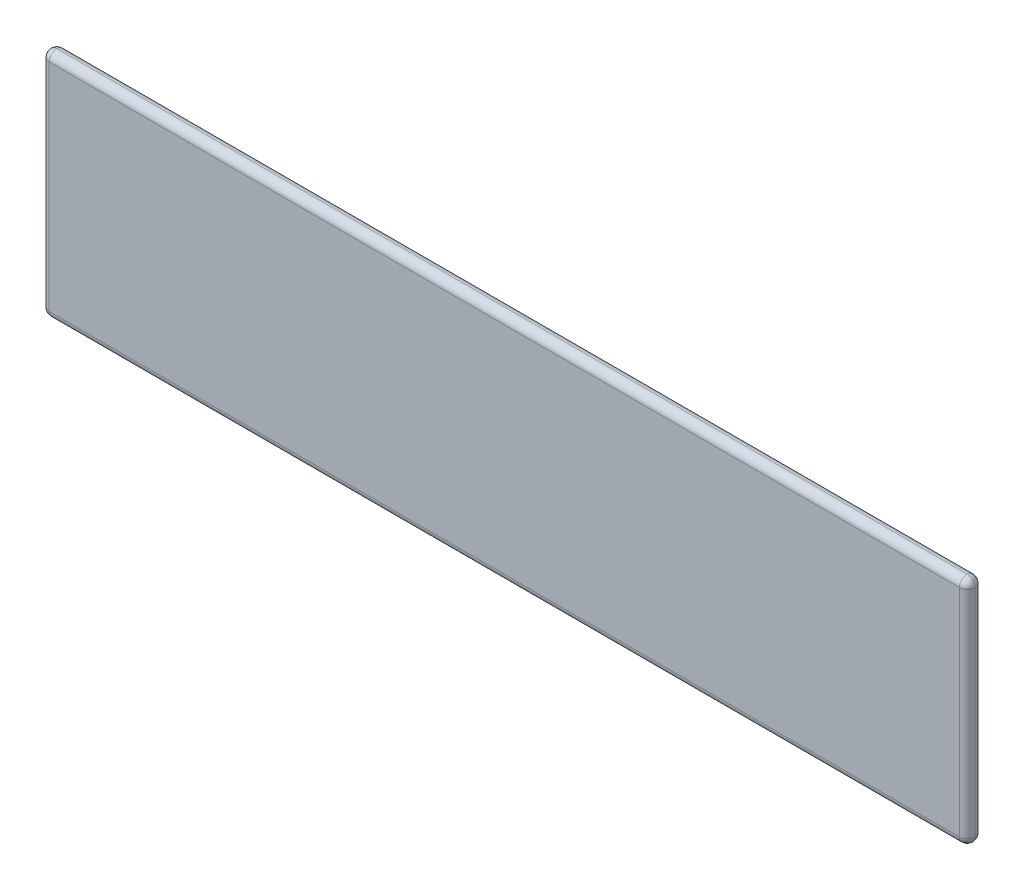
ISO-10303-21;
HEADER;
FILE_DESCRIPTION(('STEP AP214'),'2;1');
FILE_NAME('part.step','',(''),(''),'','','');
FILE_SCHEMA(('AUTOMOTIVE_DESIGN { 1 0 10303 214 1 1 1 1 }'));
ENDSEC;
DATA;
#1=APPLICATION_CONTEXT('core data for automotive mechanical design processes');
#2=APPLICATION_PROTOCOL_DEFINITION('international standard','automotive_design',2000,#1);
#3=PRODUCT_CONTEXT('',#1,'mechanical');
#4=PRODUCT('Part','Part','',(#3));
#5=PRODUCT_RELATED_PRODUCT_CATEGORY('part','',(#4));
#6=PRODUCT_DEFINITION_FORMATION('','',#4);
#7=PRODUCT_DEFINITION_CONTEXT('part definition',#1,'design');
#8=PRODUCT_DEFINITION('design','',#6,#7);
#9=PRODUCT_DEFINITION_SHAPE('','',#8);
#10=(LENGTH_UNIT() NAMED_UNIT(*) SI_UNIT(.MILLI.,.METRE.));
#11=(NAMED_UNIT(*) PLANE_ANGLE_UNIT() SI_UNIT($,.RADIAN.));
#12=(NAMED_UNIT(*) SI_UNIT($,.STERADIAN.) SOLID_ANGLE_UNIT());
#13=UNCERTAINTY_MEASURE_WITH_UNIT(LENGTH_MEASURE(1.E-05),#10,'distance_accuracy_value','');
#14=(GEOMETRIC_REPRESENTATION_CONTEXT(3) GLOBAL_UNCERTAINTY_ASSIGNED_CONTEXT((#13)) GLOBAL_UNIT_ASSIGNED_CONTEXT((#10,
#11,#12)) REPRESENTATION_CONTEXT('',''));
#15=CARTESIAN_POINT('',(0.,0.,0.));
#16=DIRECTION('',(0.,0.,1.));
#17=DIRECTION('',(1.,0.,0.));
#18=AXIS2_PLACEMENT_3D('',#15,#16,#17);
#19=CARTESIAN_POINT('',(0.,0.,10.));
#20=DIRECTION('',(0.,0.,1.));
#21=DIRECTION('',(1.,0.,0.));
#22=AXIS2_PLACEMENT_3D('',#19,#20,#21);
#23=PLANE('',#22);
#24=DIRECTION('',(-1.,0.,0.));
#25=VECTOR('',#24,1.);
#26=CARTESIAN_POINT('',(0.,-9.99999999999997,10.));
#27=LINE('',#26,#25);
#28=CARTESIAN_POINT('',(1190.,-9.99999999999997,10.));
#29=VERTEX_POINT('',#28);
#30=CARTESIAN_POINT('',(9.99999999999997,-9.99999999999997,10.));
#31=VERTEX_POINT('',#30);
#32=EDGE_CURVE('E120',#29,#31,#27,.T.);
#33=ORIENTED_EDGE('',*,*,#32,.T.);
#34=DIRECTION('',(0.,-1.,0.));
#35=VECTOR('',#34,1.);
#36=CARTESIAN_POINT('',(10.,-300.,10.));
#37=LINE('',#36,#35);
#38=CARTESIAN_POINT('',(10.,-290.,10.));
#39=VERTEX_POINT('',#38);
#40=EDGE_CURVE('E11',#31,#39,#37,.T.);
#41=ORIENTED_EDGE('',*,*,#40,.T.);
#42=DIRECTION('',(1.,0.,0.));
#43=VECTOR('',#42,1.);
#44=CARTESIAN_POINT('',(1200.,-290.,10.));
#45=LINE('',#44,#43);
#46=CARTESIAN_POINT('',(1190.,-290.,10.));
#47=VERTEX_POINT('',#46);
#48=EDGE_CURVE('E50',#39,#47,#45,.T.);
#49=ORIENTED_EDGE('',*,*,#48,.T.);
#50=DIRECTION('',(0.,1.,0.));
#51=VECTOR('',#50,1.);
#52=CARTESIAN_POINT('',(1190.,0.,10.));
#53=LINE('',#52,#51);
#54=EDGE_CURVE('E122',#47,#29,#53,.T.);
#55=ORIENTED_EDGE('',*,*,#54,.T.);
#56=EDGE_LOOP('',(#33,#41,#49,#55));
#57=FACE_BOUND('',#56,.T.);
#58=ADVANCED_FACE('F39',(#57),#23,.T.);
#59=CARTESIAN_POINT('',(0.,0.,-10.));
#60=DIRECTION('',(0.,0.,1.));
#61=DIRECTION('',(1.,0.,0.));
#62=AXIS2_PLACEMENT_3D('',#59,#60,#61);
#63=PLANE('',#62);
#64=DIRECTION('',(1.,0.,0.));
#65=VECTOR('',#64,1.);
#66=CARTESIAN_POINT('',(0.,-290.,-10.));
#67=LINE('',#66,#65);
#68=CARTESIAN_POINT('',(1190.,-290.,-10.));
#69=VERTEX_POINT('',#68);
#70=CARTESIAN_POINT('',(10.,-290.,-10.));
#71=VERTEX_POINT('',#70);
#72=EDGE_CURVE('E392',#69,#71,#67,.F.);
#73=ORIENTED_EDGE('',*,*,#72,.T.);
#74=DIRECTION('',(0.,-1.,0.));
#75=VECTOR('',#74,1.);
#76=CARTESIAN_POINT('',(9.99999999999997,0.,-10.));
#77=LINE('',#76,#75);
#78=CARTESIAN_POINT('',(9.99999999999997,-9.99999999999997,-10.));
#79=VERTEX_POINT('',#78);
#80=EDGE_CURVE('E127',#71,#79,#77,.F.);
#81=ORIENTED_EDGE('',*,*,#80,.T.);
#82=DIRECTION('',(-1.,0.,0.));
#83=VECTOR('',#82,1.);
#84=CARTESIAN_POINT('',(0.,-9.99999999999997,-10.));
#85=LINE('',#84,#83);
#86=CARTESIAN_POINT('',(1190.,-9.99999999999997,-10.));
#87=VERTEX_POINT('',#86);
#88=EDGE_CURVE('E323',#79,#87,#85,.F.);
#89=ORIENTED_EDGE('',*,*,#88,.T.);
#90=DIRECTION('',(0.,1.,0.));
#91=VECTOR('',#90,1.);
#92=CARTESIAN_POINT('',(1190.,0.,-10.));
#93=LINE('',#92,#91);
#94=EDGE_CURVE('E326',#87,#69,#93,.F.);
#95=ORIENTED_EDGE('',*,*,#94,.T.);
#96=EDGE_LOOP('',(#73,#81,#89,#95));
#97=FACE_BOUND('',#96,.T.);
#98=ADVANCED_FACE('F162',(#97),#63,.F.);
#99=CARTESIAN_POINT('',(1190.,0.,0.));
#100=DIRECTION('',(0.,-1.,0.));
#101=DIRECTION('',(0.,0.,-1.));
#102=AXIS2_PLACEMENT_3D('',#99,#100,#101);
#103=CYLINDRICAL_SURFACE('',#102,9.99999999999997);
#104=DIRECTION('',(0.,1.,0.));
#105=VECTOR('',#104,1.);
#106=CARTESIAN_POINT('',(1200.,-300.,0.));
#107=LINE('',#106,#105);
#108=CARTESIAN_POINT('',(1200.,-9.99999999999997,0.));
#109=VERTEX_POINT('',#108);
#110=CARTESIAN_POINT('',(1200.,-290.,0.));
#111=VERTEX_POINT('',#110);
#112=EDGE_CURVE('E312',#109,#111,#107,.F.);
#113=ORIENTED_EDGE('',*,*,#112,.F.);
#114=CARTESIAN_POINT('',(1190.,-9.99999999999997,0.));
#115=DIRECTION('',(0.,1.,0.));
#116=DIRECTION('',(0.,0.,1.));
#117=AXIS2_PLACEMENT_3D('',#114,#115,#116);
#118=CIRCLE('',#117,9.99999999999997);
#119=EDGE_CURVE('E43',#29,#109,#118,.T.);
#120=ORIENTED_EDGE('',*,*,#119,.F.);
#121=ORIENTED_EDGE('',*,*,#54,.F.);
#122=CARTESIAN_POINT('',(1190.,-290.,0.));
#123=DIRECTION('',(0.,-1.,0.));
#124=DIRECTION('',(0.,0.,-1.));
#125=AXIS2_PLACEMENT_3D('',#122,#123,#124);
#126=CIRCLE('',#125,9.99999999999997);
#127=EDGE_CURVE('E88',#111,#47,#126,.T.);
#128=ORIENTED_EDGE('',*,*,#127,.F.);
#129=EDGE_LOOP('',(#113,#120,#121,#128));
#130=FACE_BOUND('',#129,.T.);
#131=ADVANCED_FACE('F41',(#130),#103,.T.);
#132=CARTESIAN_POINT('',(1190.,-9.99999999999997,0.));
#133=DIRECTION('',(1.,0.,0.));
#134=DIRECTION('',(0.,0.,-1.));
#135=AXIS2_PLACEMENT_3D('',#132,#133,#134);
#136=SPHERICAL_SURFACE('',#135,9.99999999999997);
#137=ORIENTED_EDGE('',*,*,#119,.T.);
#138=CARTESIAN_POINT('',(1190.,-9.99999999999997,0.));
#139=DIRECTION('',(0.,0.,-1.));
#140=DIRECTION('',(-1.,0.,0.));
#141=AXIS2_PLACEMENT_3D('',#138,#139,#140);
#142=CIRCLE('',#141,9.99999999999997);
#143=CARTESIAN_POINT('',(1190.,0.,0.));
#144=VERTEX_POINT('',#143);
#145=EDGE_CURVE('E95',#144,#109,#142,.T.);
#146=ORIENTED_EDGE('',*,*,#145,.F.);
#147=CARTESIAN_POINT('',(1190.,-9.99999999999997,0.));
#148=DIRECTION('',(1.,0.,0.));
#149=DIRECTION('',(0.,0.,-1.));
#150=AXIS2_PLACEMENT_3D('',#147,#148,#149);
#151=CIRCLE('',#150,9.99999999999997);
#152=EDGE_CURVE('E321',#29,#144,#151,.F.);
#153=ORIENTED_EDGE('',*,*,#152,.F.);
#154=EDGE_LOOP('',(#137,#146,#153));
#155=FACE_BOUND('',#154,.T.);
#156=ADVANCED_FACE('F281',(#155),#136,.T.);
#157=CARTESIAN_POINT('',(1190.,-290.,0.));
#158=DIRECTION('',(1.,0.,0.));
#159=DIRECTION('',(0.,0.,-1.));
#160=AXIS2_PLACEMENT_3D('',#157,#158,#159);
#161=SPHERICAL_SURFACE('',#160,9.99999999999997);
#162=CARTESIAN_POINT('',(1190.,-290.,0.));
#163=DIRECTION('',(0.,0.,1.));
#164=DIRECTION('',(1.,0.,0.));
#165=AXIS2_PLACEMENT_3D('',#162,#163,#164);
#166=CIRCLE('',#165,9.99999999999997);
#167=CARTESIAN_POINT('',(1190.,-300.,0.));
#168=VERTEX_POINT('',#167);
#169=EDGE_CURVE('E318',#111,#168,#166,.F.);
#170=ORIENTED_EDGE('',*,*,#169,.F.);
#171=ORIENTED_EDGE('',*,*,#127,.T.);
#172=CARTESIAN_POINT('',(1190.,-290.,0.));
#173=DIRECTION('',(1.,0.,0.));
#174=DIRECTION('',(0.,0.,-1.));
#175=AXIS2_PLACEMENT_3D('',#172,#173,#174);
#176=CIRCLE('',#175,9.99999999999997);
#177=EDGE_CURVE('E339',#168,#47,#176,.F.);
#178=ORIENTED_EDGE('',*,*,#177,.F.);
#179=EDGE_LOOP('',(#170,#171,#178));
#180=FACE_BOUND('',#179,.T.);
#181=ADVANCED_FACE('F271',(#180),#161,.T.);
#182=CARTESIAN_POINT('',(1190.,0.,0.));
#183=DIRECTION('',(0.,1.,0.));
#184=DIRECTION('',(0.,0.,1.));
#185=AXIS2_PLACEMENT_3D('',#182,#183,#184);
#186=CYLINDRICAL_SURFACE('',#185,9.99999999999997);
#187=CARTESIAN_POINT('',(1190.,-9.99999999999997,0.));
#188=DIRECTION('',(0.,1.,0.));
#189=DIRECTION('',(0.,0.,1.));
#190=AXIS2_PLACEMENT_3D('',#187,#188,#189);
#191=CIRCLE('',#190,9.99999999999997);
#192=EDGE_CURVE('E319',#109,#87,#191,.T.);
#193=ORIENTED_EDGE('',*,*,#192,.F.);
#194=ORIENTED_EDGE('',*,*,#112,.T.);
#195=CARTESIAN_POINT('',(1190.,-290.,0.));
#196=DIRECTION('',(0.,-1.,0.));
#197=DIRECTION('',(0.,0.,-1.));
#198=AXIS2_PLACEMENT_3D('',#195,#196,#197);
#199=CIRCLE('',#198,9.99999999999997);
#200=EDGE_CURVE('E342',#69,#111,#199,.T.);
#201=ORIENTED_EDGE('',*,*,#200,.F.);
#202=ORIENTED_EDGE('',*,*,#94,.F.);
#203=EDGE_LOOP('',(#193,#194,#201,#202));
#204=FACE_BOUND('',#203,.T.);
#205=ADVANCED_FACE('F262',(#204),#186,.T.);
#206=CARTESIAN_POINT('',(1190.,-9.99999999999997,0.));
#207=DIRECTION('',(1.,0.,0.));
#208=DIRECTION('',(0.,0.,-1.));
#209=AXIS2_PLACEMENT_3D('',#206,#207,#208);
#210=SPHERICAL_SURFACE('',#209,9.99999999999997);
#211=ORIENTED_EDGE('',*,*,#145,.T.);
#212=ORIENTED_EDGE('',*,*,#192,.T.);
#213=CARTESIAN_POINT('',(1190.,-9.99999999999997,0.));
#214=DIRECTION('',(1.,0.,0.));
#215=DIRECTION('',(0.,0.,-1.));
#216=AXIS2_PLACEMENT_3D('',#213,#214,#215);
#217=CIRCLE('',#216,9.99999999999997);
#218=EDGE_CURVE('E345',#144,#87,#217,.F.);
#219=ORIENTED_EDGE('',*,*,#218,.F.);
#220=EDGE_LOOP('',(#211,#212,#219));
#221=FACE_BOUND('',#220,.T.);
#222=ADVANCED_FACE('F253',(#221),#210,.T.);
#223=CARTESIAN_POINT('',(0.,-9.99999999999997,0.));
#224=DIRECTION('',(1.,0.,0.));
#225=DIRECTION('',(0.,0.,-1.));
#226=AXIS2_PLACEMENT_3D('',#223,#224,#225);
#227=CYLINDRICAL_SURFACE('',#226,9.99999999999997);
#228=ORIENTED_EDGE('',*,*,#32,.F.);
#229=ORIENTED_EDGE('',*,*,#152,.T.);
#230=DIRECTION('',(-1.,0.,0.));
#231=VECTOR('',#230,1.);
#232=CARTESIAN_POINT('',(1200.,0.,0.));
#233=LINE('',#232,#231);
#234=CARTESIAN_POINT('',(9.99999999999997,0.,0.));
#235=VERTEX_POINT('',#234);
#236=EDGE_CURVE('E134',#235,#144,#233,.F.);
#237=ORIENTED_EDGE('',*,*,#236,.F.);
#238=CARTESIAN_POINT('',(9.99999999999997,-9.99999999999997,0.));
#239=DIRECTION('',(-1.,0.,0.));
#240=DIRECTION('',(0.,0.,1.));
#241=AXIS2_PLACEMENT_3D('',#238,#239,#240);
#242=CIRCLE('',#241,9.99999999999997);
#243=EDGE_CURVE('E130',#31,#235,#242,.T.);
#244=ORIENTED_EDGE('',*,*,#243,.F.);
#245=EDGE_LOOP('',(#228,#229,#237,#244));
#246=FACE_BOUND('',#245,.T.);
#247=ADVANCED_FACE('F132',(#246),#227,.T.);
#248=CARTESIAN_POINT('',(0.,-290.,0.));
#249=DIRECTION('',(-1.,0.,0.));
#250=DIRECTION('',(0.,0.,1.));
#251=AXIS2_PLACEMENT_3D('',#248,#249,#250);
#252=CYLINDRICAL_SURFACE('',#251,9.99999999999997);
#253=ORIENTED_EDGE('',*,*,#177,.T.);
#254=ORIENTED_EDGE('',*,*,#48,.F.);
#255=CARTESIAN_POINT('',(10.,-290.,0.));
#256=DIRECTION('',(-1.,0.,0.));
#257=DIRECTION('',(0.,0.,1.));
#258=AXIS2_PLACEMENT_3D('',#255,#256,#257);
#259=CIRCLE('',#258,9.99999999999997);
#260=CARTESIAN_POINT('',(10.,-300.,0.));
#261=VERTEX_POINT('',#260);
#262=EDGE_CURVE('E138',#261,#39,#259,.T.);
#263=ORIENTED_EDGE('',*,*,#262,.F.);
#264=DIRECTION('',(1.,0.,0.));
#265=VECTOR('',#264,1.);
#266=CARTESIAN_POINT('',(0.,-300.,0.));
#267=LINE('',#266,#265);
#268=EDGE_CURVE('E357',#168,#261,#267,.F.);
#269=ORIENTED_EDGE('',*,*,#268,.F.);
#270=EDGE_LOOP('',(#253,#254,#263,#269));
#271=FACE_BOUND('',#270,.T.);
#272=ADVANCED_FACE('F234',(#271),#252,.T.);
#273=CARTESIAN_POINT('',(1190.,-290.,0.));
#274=DIRECTION('',(1.,0.,0.));
#275=DIRECTION('',(0.,0.,-1.));
#276=AXIS2_PLACEMENT_3D('',#273,#274,#275);
#277=SPHERICAL_SURFACE('',#276,9.99999999999997);
#278=ORIENTED_EDGE('',*,*,#200,.T.);
#279=ORIENTED_EDGE('',*,*,#169,.T.);
#280=CARTESIAN_POINT('',(1190.,-290.,0.));
#281=DIRECTION('',(1.,0.,0.));
#282=DIRECTION('',(0.,0.,-1.));
#283=AXIS2_PLACEMENT_3D('',#280,#281,#282);
#284=CIRCLE('',#283,9.99999999999997);
#285=EDGE_CURVE('E361',#69,#168,#284,.F.);
#286=ORIENTED_EDGE('',*,*,#285,.F.);
#287=EDGE_LOOP('',(#278,#279,#286));
#288=FACE_BOUND('',#287,.T.);
#289=ADVANCED_FACE('F224',(#288),#277,.T.);
#290=CARTESIAN_POINT('',(0.,-9.99999999999997,0.));
#291=DIRECTION('',(-1.,0.,0.));
#292=DIRECTION('',(0.,0.,1.));
#293=AXIS2_PLACEMENT_3D('',#290,#291,#292);
#294=CYLINDRICAL_SURFACE('',#293,9.99999999999997);
#295=CARTESIAN_POINT('',(9.99999999999997,-9.99999999999997,0.));
#296=DIRECTION('',(-1.,0.,0.));
#297=DIRECTION('',(0.,0.,1.));
#298=AXIS2_PLACEMENT_3D('',#295,#296,#297);
#299=CIRCLE('',#298,9.99999999999997);
#300=EDGE_CURVE('E365',#235,#79,#299,.T.);
#301=ORIENTED_EDGE('',*,*,#300,.F.);
#302=ORIENTED_EDGE('',*,*,#236,.T.);
#303=ORIENTED_EDGE('',*,*,#218,.T.);
#304=ORIENTED_EDGE('',*,*,#88,.F.);
#305=EDGE_LOOP('',(#301,#302,#303,#304));
#306=FACE_BOUND('',#305,.T.);
#307=ADVANCED_FACE('F215',(#306),#294,.T.);
#308=CARTESIAN_POINT('',(9.99999999999997,-9.99999999999997,0.));
#309=DIRECTION('',(0.,1.,0.));
#310=DIRECTION('',(0.,0.,1.));
#311=AXIS2_PLACEMENT_3D('',#308,#309,#310);
#312=SPHERICAL_SURFACE('',#311,9.99999999999997);
#313=ORIENTED_EDGE('',*,*,#243,.T.);
#314=CARTESIAN_POINT('',(9.99999999999997,-9.99999999999997,0.));
#315=DIRECTION('',(0.,0.,-1.));
#316=DIRECTION('',(-1.,0.,0.));
#317=AXIS2_PLACEMENT_3D('',#314,#315,#316);
#318=CIRCLE('',#317,9.99999999999997);
#319=CARTESIAN_POINT('',(0.,-9.99999999999997,0.));
#320=VERTEX_POINT('',#319);
#321=EDGE_CURVE('E143',#320,#235,#318,.T.);
#322=ORIENTED_EDGE('',*,*,#321,.F.);
#323=CARTESIAN_POINT('',(9.99999999999997,-9.99999999999997,0.));
#324=DIRECTION('',(0.,1.,0.));
#325=DIRECTION('',(-1.,0.,0.));
#326=AXIS2_PLACEMENT_3D('',#323,#324,#325);
#327=CIRCLE('',#326,9.99999999999997);
#328=EDGE_CURVE('E141',#31,#320,#327,.F.);
#329=ORIENTED_EDGE('',*,*,#328,.F.);
#330=EDGE_LOOP('',(#313,#322,#329));
#331=FACE_BOUND('',#330,.T.);
#332=ADVANCED_FACE('F142',(#331),#312,.T.);
#333=CARTESIAN_POINT('',(10.,-290.,0.));
#334=DIRECTION('',(0.,-1.,0.));
#335=DIRECTION('',(0.,0.,-1.));
#336=AXIS2_PLACEMENT_3D('',#333,#334,#335);
#337=SPHERICAL_SURFACE('',#336,9.99999999999997);
#338=CARTESIAN_POINT('',(10.,-290.,0.));
#339=DIRECTION('',(0.,0.,1.));
#340=DIRECTION('',(1.,0.,0.));
#341=AXIS2_PLACEMENT_3D('',#338,#339,#340);
#342=CIRCLE('',#341,9.99999999999997);
#343=CARTESIAN_POINT('',(0.,-290.,0.));
#344=VERTEX_POINT('',#343);
#345=EDGE_CURVE('E353',#261,#344,#342,.F.);
#346=ORIENTED_EDGE('',*,*,#345,.F.);
#347=ORIENTED_EDGE('',*,*,#262,.T.);
#348=CARTESIAN_POINT('',(10.,-290.,0.));
#349=DIRECTION('',(0.,-1.,0.));
#350=DIRECTION('',(0.,0.,-1.));
#351=AXIS2_PLACEMENT_3D('',#348,#349,#350);
#352=CIRCLE('',#351,9.99999999999997);
#353=EDGE_CURVE('E59',#344,#39,#352,.F.);
#354=ORIENTED_EDGE('',*,*,#353,.F.);
#355=EDGE_LOOP('',(#346,#347,#354));
#356=FACE_BOUND('',#355,.T.);
#357=ADVANCED_FACE('F196',(#356),#337,.T.);
#358=CARTESIAN_POINT('',(0.,-290.,0.));
#359=DIRECTION('',(1.,0.,0.));
#360=DIRECTION('',(0.,0.,-1.));
#361=AXIS2_PLACEMENT_3D('',#358,#359,#360);
#362=CYLINDRICAL_SURFACE('',#361,9.99999999999997);
#363=ORIENTED_EDGE('',*,*,#285,.T.);
#364=ORIENTED_EDGE('',*,*,#268,.T.);
#365=CARTESIAN_POINT('',(10.,-290.,0.));
#366=DIRECTION('',(-1.,0.,0.));
#367=DIRECTION('',(0.,0.,1.));
#368=AXIS2_PLACEMENT_3D('',#365,#366,#367);
#369=CIRCLE('',#368,9.99999999999997);
#370=EDGE_CURVE('E372',#71,#261,#369,.T.);
#371=ORIENTED_EDGE('',*,*,#370,.F.);
#372=ORIENTED_EDGE('',*,*,#72,.F.);
#373=EDGE_LOOP('',(#363,#364,#371,#372));
#374=FACE_BOUND('',#373,.T.);
#375=ADVANCED_FACE('F158',(#374),#362,.T.);
#376=CARTESIAN_POINT('',(9.99999999999997,-9.99999999999997,0.));
#377=DIRECTION('',(0.,1.,0.));
#378=DIRECTION('',(0.,0.,1.));
#379=AXIS2_PLACEMENT_3D('',#376,#377,#378);
#380=SPHERICAL_SURFACE('',#379,9.99999999999997);
#381=ORIENTED_EDGE('',*,*,#321,.T.);
#382=ORIENTED_EDGE('',*,*,#300,.T.);
#383=CARTESIAN_POINT('',(9.99999999999997,-9.99999999999997,0.));
#384=DIRECTION('',(0.,1.,0.));
#385=DIRECTION('',(-1.,0.,0.));
#386=AXIS2_PLACEMENT_3D('',#383,#384,#385);
#387=CIRCLE('',#386,9.99999999999997);
#388=EDGE_CURVE('E104',#320,#79,#387,.F.);
#389=ORIENTED_EDGE('',*,*,#388,.F.);
#390=EDGE_LOOP('',(#381,#382,#389));
#391=FACE_BOUND('',#390,.T.);
#392=ADVANCED_FACE('F149',(#391),#380,.T.);
#393=CARTESIAN_POINT('',(9.99999999999997,0.,0.));
#394=DIRECTION('',(0.,1.,0.));
#395=DIRECTION('',(-1.,0.,0.));
#396=AXIS2_PLACEMENT_3D('',#393,#394,#395);
#397=CYLINDRICAL_SURFACE('',#396,9.99999999999997);
#398=ORIENTED_EDGE('',*,*,#40,.F.);
#399=ORIENTED_EDGE('',*,*,#328,.T.);
#400=DIRECTION('',(0.,-1.,0.));
#401=VECTOR('',#400,1.);
#402=CARTESIAN_POINT('',(0.,0.,0.));
#403=LINE('',#402,#401);
#404=EDGE_CURVE('E378',#344,#320,#403,.F.);
#405=ORIENTED_EDGE('',*,*,#404,.F.);
#406=ORIENTED_EDGE('',*,*,#353,.T.);
#407=EDGE_LOOP('',(#398,#399,#405,#406));
#408=FACE_BOUND('',#407,.T.);
#409=ADVANCED_FACE('F146',(#408),#397,.T.);
#410=CARTESIAN_POINT('',(10.,-290.,0.));
#411=DIRECTION('',(0.,-1.,0.));
#412=DIRECTION('',(0.,0.,-1.));
#413=AXIS2_PLACEMENT_3D('',#410,#411,#412);
#414=SPHERICAL_SURFACE('',#413,9.99999999999997);
#415=ORIENTED_EDGE('',*,*,#370,.T.);
#416=ORIENTED_EDGE('',*,*,#345,.T.);
#417=CARTESIAN_POINT('',(10.,-290.,0.));
#418=DIRECTION('',(0.,-1.,0.));
#419=DIRECTION('',(0.,0.,-1.));
#420=AXIS2_PLACEMENT_3D('',#417,#418,#419);
#421=CIRCLE('',#420,9.99999999999997);
#422=EDGE_CURVE('E381',#71,#344,#421,.F.);
#423=ORIENTED_EDGE('',*,*,#422,.F.);
#424=EDGE_LOOP('',(#415,#416,#423));
#425=FACE_BOUND('',#424,.T.);
#426=ADVANCED_FACE('F148',(#425),#414,.T.);
#427=CARTESIAN_POINT('',(9.99999999999997,0.,0.));
#428=DIRECTION('',(0.,-1.,0.));
#429=DIRECTION('',(1.,0.,0.));
#430=AXIS2_PLACEMENT_3D('',#427,#428,#429);
#431=CYLINDRICAL_SURFACE('',#430,9.99999999999997);
#432=ORIENTED_EDGE('',*,*,#388,.T.);
#433=ORIENTED_EDGE('',*,*,#80,.F.);
#434=ORIENTED_EDGE('',*,*,#422,.T.);
#435=ORIENTED_EDGE('',*,*,#404,.T.);
#436=EDGE_LOOP('',(#432,#433,#434,#435));
#437=FACE_BOUND('',#436,.T.);
#438=ADVANCED_FACE('F155',(#437),#431,.T.);
#439=CLOSED_SHELL('',(#58,#98,#131,#156,#181,#205,#222,#247,#272,#289,#307,#332,#357,#375,#392,
#409,#426,#438));
#440=MANIFOLD_SOLID_BREP('B2',#439);
#441=ADVANCED_BREP_SHAPE_REPRESENTATION('',(#18,#440),#14);
#442=SHAPE_DEFINITION_REPRESENTATION(#9,#441);
ENDSEC;
END-ISO-10303-21;
